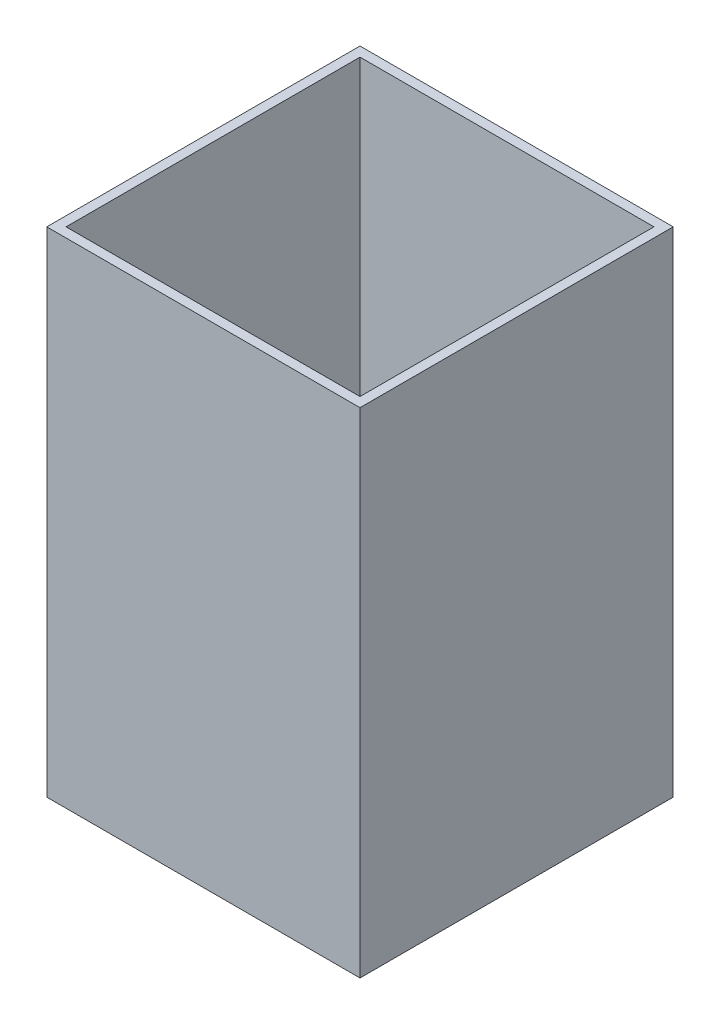
ISO-10303-21;
HEADER;
FILE_DESCRIPTION(('STEP AP214'),'2;1');
FILE_NAME('part.step','',(''),(''),'','','');
FILE_SCHEMA(('AUTOMOTIVE_DESIGN { 1 0 10303 214 1 1 1 1 }'));
ENDSEC;
DATA;
#1=APPLICATION_CONTEXT('core data for automotive mechanical design processes');
#2=APPLICATION_PROTOCOL_DEFINITION('international standard','automotive_design',2000,#1);
#3=PRODUCT_CONTEXT('',#1,'mechanical');
#4=PRODUCT('Part','Part','',(#3));
#5=PRODUCT_RELATED_PRODUCT_CATEGORY('part','',(#4));
#6=PRODUCT_DEFINITION_FORMATION('','',#4);
#7=PRODUCT_DEFINITION_CONTEXT('part definition',#1,'design');
#8=PRODUCT_DEFINITION('design','',#6,#7);
#9=PRODUCT_DEFINITION_SHAPE('','',#8);
#10=(LENGTH_UNIT() NAMED_UNIT(*) SI_UNIT(.MILLI.,.METRE.));
#11=(NAMED_UNIT(*) PLANE_ANGLE_UNIT() SI_UNIT($,.RADIAN.));
#12=(NAMED_UNIT(*) SI_UNIT($,.STERADIAN.) SOLID_ANGLE_UNIT());
#13=UNCERTAINTY_MEASURE_WITH_UNIT(LENGTH_MEASURE(1.E-05),#10,'distance_accuracy_value','');
#14=(GEOMETRIC_REPRESENTATION_CONTEXT(3) GLOBAL_UNCERTAINTY_ASSIGNED_CONTEXT((#13)) GLOBAL_UNIT_ASSIGNED_CONTEXT((#10,
#11,#12)) REPRESENTATION_CONTEXT('',''));
#15=CARTESIAN_POINT('',(0.,0.,0.));
#16=DIRECTION('',(0.,0.,1.));
#17=DIRECTION('',(1.,0.,0.));
#18=AXIS2_PLACEMENT_3D('',#15,#16,#17);
#19=CARTESIAN_POINT('',(0.,130.175,0.));
#20=DIRECTION('',(1.,0.,0.));
#21=DIRECTION('',(0.,0.,-1.));
#22=AXIS2_PLACEMENT_3D('',#19,#20,#21);
#23=PLANE('',#22);
#24=DIRECTION('',(0.,0.,1.));
#25=VECTOR('',#24,1.);
#26=CARTESIAN_POINT('',(0.,0.,0.));
#27=LINE('',#26,#25);
#28=CARTESIAN_POINT('',(0.,0.,0.));
#29=VERTEX_POINT('',#28);
#30=CARTESIAN_POINT('',(0.,0.,82.55));
#31=VERTEX_POINT('',#30);
#32=EDGE_CURVE('E150',#29,#31,#27,.T.);
#33=ORIENTED_EDGE('',*,*,#32,.T.);
#34=DIRECTION('',(0.,-1.,0.));
#35=VECTOR('',#34,1.);
#36=CARTESIAN_POINT('',(0.,130.175,82.55));
#37=LINE('',#36,#35);
#38=CARTESIAN_POINT('',(0.,130.175,82.55));
#39=VERTEX_POINT('',#38);
#40=EDGE_CURVE('E11',#39,#31,#37,.T.);
#41=ORIENTED_EDGE('',*,*,#40,.F.);
#42=DIRECTION('',(0.,0.,1.));
#43=VECTOR('',#42,1.);
#44=CARTESIAN_POINT('',(0.,130.175,0.));
#45=LINE('',#44,#43);
#46=CARTESIAN_POINT('',(0.,130.175,0.));
#47=VERTEX_POINT('',#46);
#48=EDGE_CURVE('E143',#47,#39,#45,.T.);
#49=ORIENTED_EDGE('',*,*,#48,.F.);
#50=DIRECTION('',(0.,-1.,0.));
#51=VECTOR('',#50,1.);
#52=CARTESIAN_POINT('',(0.,130.175,0.));
#53=LINE('',#52,#51);
#54=EDGE_CURVE('E149',#47,#29,#53,.T.);
#55=ORIENTED_EDGE('',*,*,#54,.T.);
#56=EDGE_LOOP('',(#33,#41,#49,#55));
#57=FACE_BOUND('',#56,.T.);
#58=ADVANCED_FACE('F36',(#57),#23,.F.);
#59=CARTESIAN_POINT('',(0.,130.175,82.55));
#60=DIRECTION('',(0.,0.,-1.));
#61=DIRECTION('',(-1.,0.,0.));
#62=AXIS2_PLACEMENT_3D('',#59,#60,#61);
#63=PLANE('',#62);
#64=DIRECTION('',(1.,0.,0.));
#65=VECTOR('',#64,1.);
#66=CARTESIAN_POINT('',(0.,0.,82.55));
#67=LINE('',#66,#65);
#68=CARTESIAN_POINT('',(82.55,0.,82.55));
#69=VERTEX_POINT('',#68);
#70=EDGE_CURVE('E153',#31,#69,#67,.T.);
#71=ORIENTED_EDGE('',*,*,#70,.T.);
#72=DIRECTION('',(0.,-1.,0.));
#73=VECTOR('',#72,1.);
#74=CARTESIAN_POINT('',(82.55,130.175,82.55));
#75=LINE('',#74,#73);
#76=CARTESIAN_POINT('',(82.55,130.175,82.55));
#77=VERTEX_POINT('',#76);
#78=EDGE_CURVE('E43',#77,#69,#75,.T.);
#79=ORIENTED_EDGE('',*,*,#78,.F.);
#80=DIRECTION('',(1.,0.,0.));
#81=VECTOR('',#80,1.);
#82=CARTESIAN_POINT('',(0.,130.175,82.55));
#83=LINE('',#82,#81);
#84=EDGE_CURVE('E87',#39,#77,#83,.T.);
#85=ORIENTED_EDGE('',*,*,#84,.F.);
#86=ORIENTED_EDGE('',*,*,#40,.T.);
#87=EDGE_LOOP('',(#71,#79,#85,#86));
#88=FACE_BOUND('',#87,.T.);
#89=ADVANCED_FACE('F182',(#88),#63,.F.);
#90=CARTESIAN_POINT('',(82.55,130.175,0.));
#91=DIRECTION('',(-1.,0.,0.));
#92=DIRECTION('',(0.,0.,1.));
#93=AXIS2_PLACEMENT_3D('',#90,#91,#92);
#94=PLANE('',#93);
#95=DIRECTION('',(0.,0.,-1.));
#96=VECTOR('',#95,1.);
#97=CARTESIAN_POINT('',(82.55,0.,0.));
#98=LINE('',#97,#96);
#99=CARTESIAN_POINT('',(82.55,0.,0.));
#100=VERTEX_POINT('',#99);
#101=EDGE_CURVE('E155',#69,#100,#98,.T.);
#102=ORIENTED_EDGE('',*,*,#101,.T.);
#103=DIRECTION('',(0.,-1.,0.));
#104=VECTOR('',#103,1.);
#105=CARTESIAN_POINT('',(82.55,130.175,0.));
#106=LINE('',#105,#104);
#107=CARTESIAN_POINT('',(82.55,130.175,0.));
#108=VERTEX_POINT('',#107);
#109=EDGE_CURVE('E159',#108,#100,#106,.T.);
#110=ORIENTED_EDGE('',*,*,#109,.F.);
#111=DIRECTION('',(0.,0.,-1.));
#112=VECTOR('',#111,1.);
#113=CARTESIAN_POINT('',(82.55,130.175,0.));
#114=LINE('',#113,#112);
#115=EDGE_CURVE('E146',#77,#108,#114,.T.);
#116=ORIENTED_EDGE('',*,*,#115,.F.);
#117=ORIENTED_EDGE('',*,*,#78,.T.);
#118=EDGE_LOOP('',(#102,#110,#116,#117));
#119=FACE_BOUND('',#118,.T.);
#120=ADVANCED_FACE('F164',(#119),#94,.F.);
#121=CARTESIAN_POINT('',(0.,130.175,0.));
#122=DIRECTION('',(0.,0.,1.));
#123=DIRECTION('',(1.,0.,0.));
#124=AXIS2_PLACEMENT_3D('',#121,#122,#123);
#125=PLANE('',#124);
#126=DIRECTION('',(-1.,0.,0.));
#127=VECTOR('',#126,1.);
#128=CARTESIAN_POINT('',(0.,0.,0.));
#129=LINE('',#128,#127);
#130=EDGE_CURVE('E80',#100,#29,#129,.T.);
#131=ORIENTED_EDGE('',*,*,#130,.T.);
#132=ORIENTED_EDGE('',*,*,#54,.F.);
#133=DIRECTION('',(-1.,0.,0.));
#134=VECTOR('',#133,1.);
#135=CARTESIAN_POINT('',(0.,130.175,0.));
#136=LINE('',#135,#134);
#137=EDGE_CURVE('E59',#108,#47,#136,.T.);
#138=ORIENTED_EDGE('',*,*,#137,.F.);
#139=ORIENTED_EDGE('',*,*,#109,.T.);
#140=EDGE_LOOP('',(#131,#132,#138,#139));
#141=FACE_BOUND('',#140,.T.);
#142=ADVANCED_FACE('F172',(#141),#125,.F.);
#143=CARTESIAN_POINT('',(0.,130.175,0.));
#144=DIRECTION('',(0.,1.,0.));
#145=DIRECTION('',(0.,0.,1.));
#146=AXIS2_PLACEMENT_3D('',#143,#144,#145);
#147=PLANE('',#146);
#148=DIRECTION('',(0.,0.,1.));
#149=VECTOR('',#148,1.);
#150=CARTESIAN_POINT('',(2.54,130.175,0.));
#151=LINE('',#150,#149);
#152=CARTESIAN_POINT('',(2.54,130.175,2.54));
#153=VERTEX_POINT('',#152);
#154=CARTESIAN_POINT('',(2.54000000000001,130.175,80.01));
#155=VERTEX_POINT('',#154);
#156=EDGE_CURVE('E132',#153,#155,#151,.T.);
#157=ORIENTED_EDGE('',*,*,#156,.F.);
#158=DIRECTION('',(-1.,0.,0.));
#159=VECTOR('',#158,1.);
#160=CARTESIAN_POINT('',(0.,130.175,2.54));
#161=LINE('',#160,#159);
#162=CARTESIAN_POINT('',(80.01,130.175,2.54));
#163=VERTEX_POINT('',#162);
#164=EDGE_CURVE('E141',#163,#153,#161,.T.);
#165=ORIENTED_EDGE('',*,*,#164,.F.);
#166=DIRECTION('',(0.,0.,-1.));
#167=VECTOR('',#166,1.);
#168=CARTESIAN_POINT('',(80.01,130.175,0.));
#169=LINE('',#168,#167);
#170=CARTESIAN_POINT('',(80.01,130.175,80.01));
#171=VERTEX_POINT('',#170);
#172=EDGE_CURVE('E139',#171,#163,#169,.T.);
#173=ORIENTED_EDGE('',*,*,#172,.F.);
#174=DIRECTION('',(1.,0.,0.));
#175=VECTOR('',#174,1.);
#176=CARTESIAN_POINT('',(0.,130.175,80.01));
#177=LINE('',#176,#175);
#178=EDGE_CURVE('E124',#155,#171,#177,.T.);
#179=ORIENTED_EDGE('',*,*,#178,.F.);
#180=EDGE_LOOP('',(#157,#165,#173,#179));
#181=FACE_BOUND('',#180,.T.);
#182=ORIENTED_EDGE('',*,*,#48,.T.);
#183=ORIENTED_EDGE('',*,*,#84,.T.);
#184=ORIENTED_EDGE('',*,*,#115,.T.);
#185=ORIENTED_EDGE('',*,*,#137,.T.);
#186=EDGE_LOOP('',(#182,#183,#184,#185));
#187=FACE_BOUND('',#186,.T.);
#188=ADVANCED_FACE('F174',(#181,#187),#147,.T.);
#189=CARTESIAN_POINT('',(0.,0.,0.));
#190=DIRECTION('',(0.,1.,0.));
#191=DIRECTION('',(0.,0.,1.));
#192=AXIS2_PLACEMENT_3D('',#189,#190,#191);
#193=PLANE('',#192);
#194=ORIENTED_EDGE('',*,*,#32,.F.);
#195=ORIENTED_EDGE('',*,*,#130,.F.);
#196=ORIENTED_EDGE('',*,*,#101,.F.);
#197=ORIENTED_EDGE('',*,*,#70,.F.);
#198=EDGE_LOOP('',(#194,#195,#196,#197));
#199=FACE_BOUND('',#198,.T.);
#200=ADVANCED_FACE('F168',(#199),#193,.F.);
#201=CARTESIAN_POINT('',(2.54,130.175,0.));
#202=DIRECTION('',(1.,0.,0.));
#203=DIRECTION('',(0.,0.,-1.));
#204=AXIS2_PLACEMENT_3D('',#201,#202,#203);
#205=PLANE('',#204);
#206=DIRECTION('',(0.,0.,1.));
#207=VECTOR('',#206,1.);
#208=CARTESIAN_POINT('',(2.54,2.53999999999999,0.));
#209=LINE('',#208,#207);
#210=CARTESIAN_POINT('',(2.54,2.54,2.54));
#211=VERTEX_POINT('',#210);
#212=CARTESIAN_POINT('',(2.54000000000001,2.54,80.01));
#213=VERTEX_POINT('',#212);
#214=EDGE_CURVE('E115',#211,#213,#209,.T.);
#215=ORIENTED_EDGE('',*,*,#214,.F.);
#216=DIRECTION('',(0.,-1.,0.));
#217=VECTOR('',#216,1.);
#218=CARTESIAN_POINT('',(2.54,130.175,2.54));
#219=LINE('',#218,#217);
#220=EDGE_CURVE('E135',#153,#211,#219,.T.);
#221=ORIENTED_EDGE('',*,*,#220,.F.);
#222=ORIENTED_EDGE('',*,*,#156,.T.);
#223=DIRECTION('',(0.,-1.,0.));
#224=VECTOR('',#223,1.);
#225=CARTESIAN_POINT('',(2.54000000000001,130.175,80.01));
#226=LINE('',#225,#224);
#227=EDGE_CURVE('E127',#155,#213,#226,.T.);
#228=ORIENTED_EDGE('',*,*,#227,.T.);
#229=EDGE_LOOP('',(#215,#221,#222,#228));
#230=FACE_BOUND('',#229,.T.);
#231=ADVANCED_FACE('F209',(#230),#205,.T.);
#232=CARTESIAN_POINT('',(0.,130.175,80.01));
#233=DIRECTION('',(0.,0.,-1.));
#234=DIRECTION('',(-1.,0.,0.));
#235=AXIS2_PLACEMENT_3D('',#232,#233,#234);
#236=PLANE('',#235);
#237=DIRECTION('',(1.,0.,0.));
#238=VECTOR('',#237,1.);
#239=CARTESIAN_POINT('',(0.,2.53999999999999,80.01));
#240=LINE('',#239,#238);
#241=CARTESIAN_POINT('',(80.01,2.54,80.01));
#242=VERTEX_POINT('',#241);
#243=EDGE_CURVE('E109',#213,#242,#240,.T.);
#244=ORIENTED_EDGE('',*,*,#243,.F.);
#245=ORIENTED_EDGE('',*,*,#227,.F.);
#246=ORIENTED_EDGE('',*,*,#178,.T.);
#247=DIRECTION('',(0.,-1.,0.));
#248=VECTOR('',#247,1.);
#249=CARTESIAN_POINT('',(80.01,130.175,80.01));
#250=LINE('',#249,#248);
#251=EDGE_CURVE('E121',#171,#242,#250,.T.);
#252=ORIENTED_EDGE('',*,*,#251,.T.);
#253=EDGE_LOOP('',(#244,#245,#246,#252));
#254=FACE_BOUND('',#253,.T.);
#255=ADVANCED_FACE('F122',(#254),#236,.T.);
#256=CARTESIAN_POINT('',(80.01,130.175,0.));
#257=DIRECTION('',(-1.,0.,0.));
#258=DIRECTION('',(0.,0.,1.));
#259=AXIS2_PLACEMENT_3D('',#256,#257,#258);
#260=PLANE('',#259);
#261=DIRECTION('',(0.,0.,-1.));
#262=VECTOR('',#261,1.);
#263=CARTESIAN_POINT('',(80.01,2.53999999999999,0.));
#264=LINE('',#263,#262);
#265=CARTESIAN_POINT('',(80.01,2.54,2.54));
#266=VERTEX_POINT('',#265);
#267=EDGE_CURVE('E113',#242,#266,#264,.T.);
#268=ORIENTED_EDGE('',*,*,#267,.F.);
#269=ORIENTED_EDGE('',*,*,#251,.F.);
#270=ORIENTED_EDGE('',*,*,#172,.T.);
#271=DIRECTION('',(0.,-1.,0.));
#272=VECTOR('',#271,1.);
#273=CARTESIAN_POINT('',(80.01,130.175,2.54));
#274=LINE('',#273,#272);
#275=EDGE_CURVE('E50',#163,#266,#274,.T.);
#276=ORIENTED_EDGE('',*,*,#275,.T.);
#277=EDGE_LOOP('',(#268,#269,#270,#276));
#278=FACE_BOUND('',#277,.T.);
#279=ADVANCED_FACE('F129',(#278),#260,.T.);
#280=CARTESIAN_POINT('',(0.,130.175,2.54));
#281=DIRECTION('',(0.,0.,1.));
#282=DIRECTION('',(1.,0.,0.));
#283=AXIS2_PLACEMENT_3D('',#280,#281,#282);
#284=PLANE('',#283);
#285=DIRECTION('',(-1.,0.,0.));
#286=VECTOR('',#285,1.);
#287=CARTESIAN_POINT('',(0.,2.53999999999999,2.54));
#288=LINE('',#287,#286);
#289=EDGE_CURVE('E130',#266,#211,#288,.T.);
#290=ORIENTED_EDGE('',*,*,#289,.F.);
#291=ORIENTED_EDGE('',*,*,#275,.F.);
#292=ORIENTED_EDGE('',*,*,#164,.T.);
#293=ORIENTED_EDGE('',*,*,#220,.T.);
#294=EDGE_LOOP('',(#290,#291,#292,#293));
#295=FACE_BOUND('',#294,.T.);
#296=ADVANCED_FACE('F239',(#295),#284,.T.);
#297=CARTESIAN_POINT('',(0.,2.54,0.));
#298=DIRECTION('',(0.,1.,0.));
#299=DIRECTION('',(0.,0.,1.));
#300=AXIS2_PLACEMENT_3D('',#297,#298,#299);
#301=PLANE('',#300);
#302=ORIENTED_EDGE('',*,*,#214,.T.);
#303=ORIENTED_EDGE('',*,*,#243,.T.);
#304=ORIENTED_EDGE('',*,*,#267,.T.);
#305=ORIENTED_EDGE('',*,*,#289,.T.);
#306=EDGE_LOOP('',(#302,#303,#304,#305));
#307=FACE_BOUND('',#306,.T.);
#308=ADVANCED_FACE('F111',(#307),#301,.T.);
#309=CLOSED_SHELL('',(#58,#89,#120,#142,#188,#200,#231,#255,#279,#296,#308));
#310=MANIFOLD_SOLID_BREP('B2',#309);
#311=ADVANCED_BREP_SHAPE_REPRESENTATION('',(#18,#310),#14);
#312=SHAPE_DEFINITION_REPRESENTATION(#9,#311);
ENDSEC;
END-ISO-10303-21;
